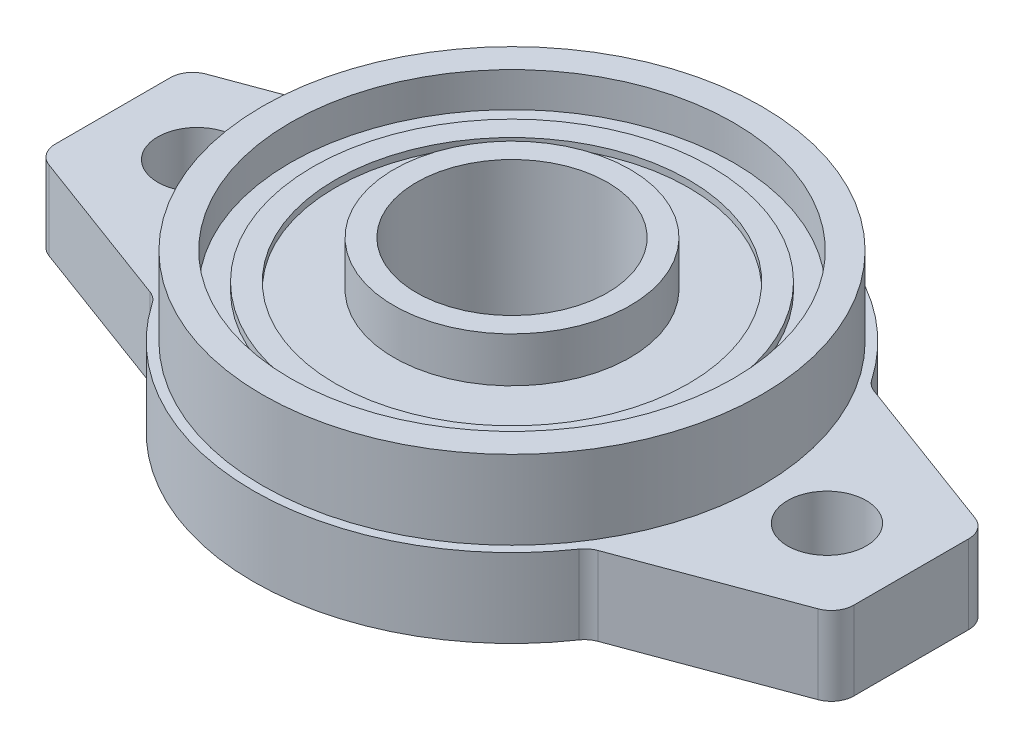
ISO-10303-21;
HEADER;
FILE_DESCRIPTION(('STEP AP214'),'2;1');
FILE_NAME('part.step','',(''),(''),'','','');
FILE_SCHEMA(('AUTOMOTIVE_DESIGN { 1 0 10303 214 1 1 1 1 }'));
ENDSEC;
DATA;
#1=APPLICATION_CONTEXT('core data for automotive mechanical design processes');
#2=APPLICATION_PROTOCOL_DEFINITION('international standard','automotive_design',2000,#1);
#3=PRODUCT_CONTEXT('',#1,'mechanical');
#4=PRODUCT('Part','Part','',(#3));
#5=PRODUCT_RELATED_PRODUCT_CATEGORY('part','',(#4));
#6=PRODUCT_DEFINITION_FORMATION('','',#4);
#7=PRODUCT_DEFINITION_CONTEXT('part definition',#1,'design');
#8=PRODUCT_DEFINITION('design','',#6,#7);
#9=PRODUCT_DEFINITION_SHAPE('','',#8);
#10=(LENGTH_UNIT() NAMED_UNIT(*) SI_UNIT(.MILLI.,.METRE.));
#11=(NAMED_UNIT(*) PLANE_ANGLE_UNIT() SI_UNIT($,.RADIAN.));
#12=(NAMED_UNIT(*) SI_UNIT($,.STERADIAN.) SOLID_ANGLE_UNIT());
#13=UNCERTAINTY_MEASURE_WITH_UNIT(LENGTH_MEASURE(1.E-05),#10,'distance_accuracy_value','');
#14=(GEOMETRIC_REPRESENTATION_CONTEXT(3) GLOBAL_UNCERTAINTY_ASSIGNED_CONTEXT((#13)) GLOBAL_UNIT_ASSIGNED_CONTEXT((#10,
#11,#12)) REPRESENTATION_CONTEXT('',''));
#15=CARTESIAN_POINT('',(0.,0.,0.));
#16=DIRECTION('',(0.,0.,1.));
#17=DIRECTION('',(1.,0.,0.));
#18=AXIS2_PLACEMENT_3D('',#15,#16,#17);
#19=CARTESIAN_POINT('',(-20.6101915487471,7.,-14.1499118132925));
#20=DIRECTION('',(0.,1.,0.));
#21=DIRECTION('',(0.,0.,1.));
#22=AXIS2_PLACEMENT_3D('',#19,#20,#21);
#23=PLANE('',#22);
#24=CARTESIAN_POINT('',(28.,7.,0.));
#25=DIRECTION('',(0.,1.,0.));
#26=DIRECTION('',(0.,0.,1.));
#27=AXIS2_PLACEMENT_3D('',#24,#25,#26);
#28=CIRCLE('',#27,3.5);
#29=CARTESIAN_POINT('',(28.,7.,3.5));
#30=VERTEX_POINT('',#29);
#31=EDGE_CURVE('E188',#30,#30,#28,.T.);
#32=ORIENTED_EDGE('',*,*,#31,.F.);
#33=EDGE_LOOP('',(#32));
#34=FACE_BOUND('',#33,.T.);
#35=CARTESIAN_POINT('',(-20.6101915487471,7.,-14.1499118132925));
#36=DIRECTION('',(0.,-1.,0.));
#37=DIRECTION('',(0.,0.,1.));
#38=AXIS2_PLACEMENT_3D('',#35,#36,#37);
#39=CIRCLE('',#38,2.);
#40=CARTESIAN_POINT('',(-18.9613762248473,7.,-13.0179188682291));
#41=VERTEX_POINT('',#40);
#42=CARTESIAN_POINT('',(-19.915308816529,7.,-12.2745083931012));
#43=VERTEX_POINT('',#42);
#44=EDGE_CURVE('E215',#41,#43,#39,.T.);
#45=ORIENTED_EDGE('',*,*,#44,.T.);
#46=DIRECTION('',(-0.93770171009564,0.,0.347441366109035));
#47=VECTOR('',#46,1.);
#48=CARTESIAN_POINT('',(-19.915308816529,7.,-12.2745083931012));
#49=LINE('',#48,#47);
#50=CARTESIAN_POINT('',(-34.1948827322181,7.,-6.98357779618894));
#51=VERTEX_POINT('',#50);
#52=EDGE_CURVE('E123',#43,#51,#49,.T.);
#53=ORIENTED_EDGE('',*,*,#52,.T.);
#54=CARTESIAN_POINT('',(-33.5,7.,-5.10817437599766));
#55=DIRECTION('',(0.,1.,0.));
#56=DIRECTION('',(0.,0.,1.));
#57=AXIS2_PLACEMENT_3D('',#54,#55,#56);
#58=CIRCLE('',#57,2.);
#59=CARTESIAN_POINT('',(-35.5,7.,-5.10817437599766));
#60=VERTEX_POINT('',#59);
#61=EDGE_CURVE('E254',#51,#60,#58,.T.);
#62=ORIENTED_EDGE('',*,*,#61,.T.);
#63=DIRECTION('',(0.,0.,1.));
#64=VECTOR('',#63,1.);
#65=CARTESIAN_POINT('',(-35.5,7.,-5.10817437599766));
#66=LINE('',#65,#64);
#67=CARTESIAN_POINT('',(-35.5,7.,5.10817437599766));
#68=VERTEX_POINT('',#67);
#69=EDGE_CURVE('E273',#60,#68,#66,.T.);
#70=ORIENTED_EDGE('',*,*,#69,.T.);
#71=CARTESIAN_POINT('',(-33.5,7.,5.10817437599766));
#72=DIRECTION('',(0.,1.,0.));
#73=DIRECTION('',(0.,0.,-1.));
#74=AXIS2_PLACEMENT_3D('',#71,#72,#73);
#75=CIRCLE('',#74,2.);
#76=CARTESIAN_POINT('',(-34.1948827322181,7.,6.98357779618894));
#77=VERTEX_POINT('',#76);
#78=EDGE_CURVE('E270',#68,#77,#75,.T.);
#79=ORIENTED_EDGE('',*,*,#78,.T.);
#80=DIRECTION('',(0.93770171009564,0.,0.347441366109035));
#81=VECTOR('',#80,1.);
#82=CARTESIAN_POINT('',(-34.1948827322181,7.,6.98357779618894));
#83=LINE('',#82,#81);
#84=CARTESIAN_POINT('',(-19.915308816529,7.,12.2745083931012));
#85=VERTEX_POINT('',#84);
#86=EDGE_CURVE('E272',#77,#85,#83,.T.);
#87=ORIENTED_EDGE('',*,*,#86,.T.);
#88=CARTESIAN_POINT('',(-20.6101915487471,7.,14.1499118132925));
#89=DIRECTION('',(0.,-1.,0.));
#90=DIRECTION('',(0.,0.,-1.));
#91=AXIS2_PLACEMENT_3D('',#88,#89,#90);
#92=CIRCLE('',#91,2.);
#93=CARTESIAN_POINT('',(-18.9613762248473,7.,13.0179188682291));
#94=VERTEX_POINT('',#93);
#95=EDGE_CURVE('E275',#85,#94,#92,.T.);
#96=ORIENTED_EDGE('',*,*,#95,.T.);
#97=CARTESIAN_POINT('',(0.,7.,0.));
#98=DIRECTION('',(0.,1.,0.));
#99=DIRECTION('',(0.,0.,1.));
#100=AXIS2_PLACEMENT_3D('',#97,#98,#99);
#101=CIRCLE('',#100,23.);
#102=CARTESIAN_POINT('',(18.9613762248473,7.,13.0179188682291));
#103=VERTEX_POINT('',#102);
#104=EDGE_CURVE('E281',#94,#103,#101,.T.);
#105=ORIENTED_EDGE('',*,*,#104,.T.);
#106=CARTESIAN_POINT('',(20.6101915487471,7.,14.1499118132925));
#107=DIRECTION('',(0.,-1.,0.));
#108=DIRECTION('',(0.,0.,1.));
#109=AXIS2_PLACEMENT_3D('',#106,#107,#108);
#110=CIRCLE('',#109,2.);
#111=CARTESIAN_POINT('',(19.915308816529,7.,12.2745083931012));
#112=VERTEX_POINT('',#111);
#113=EDGE_CURVE('E283',#103,#112,#110,.T.);
#114=ORIENTED_EDGE('',*,*,#113,.T.);
#115=DIRECTION('',(0.93770171009564,0.,-0.347441366109035));
#116=VECTOR('',#115,1.);
#117=CARTESIAN_POINT('',(34.1948827322181,7.,6.98357779618894));
#118=LINE('',#117,#116);
#119=CARTESIAN_POINT('',(34.1948827322181,7.,6.98357779618894));
#120=VERTEX_POINT('',#119);
#121=EDGE_CURVE('E285',#112,#120,#118,.T.);
#122=ORIENTED_EDGE('',*,*,#121,.T.);
#123=CARTESIAN_POINT('',(33.5,7.,5.10817437599766));
#124=DIRECTION('',(0.,1.,0.));
#125=DIRECTION('',(0.,0.,-1.));
#126=AXIS2_PLACEMENT_3D('',#123,#124,#125);
#127=CIRCLE('',#126,2.);
#128=CARTESIAN_POINT('',(35.5,7.,5.10817437599766));
#129=VERTEX_POINT('',#128);
#130=EDGE_CURVE('E287',#120,#129,#127,.T.);
#131=ORIENTED_EDGE('',*,*,#130,.T.);
#132=DIRECTION('',(0.,0.,-1.));
#133=VECTOR('',#132,1.);
#134=CARTESIAN_POINT('',(35.5,7.,-5.10817437599766));
#135=LINE('',#134,#133);
#136=CARTESIAN_POINT('',(35.5,7.,-5.10817437599766));
#137=VERTEX_POINT('',#136);
#138=EDGE_CURVE('E289',#129,#137,#135,.T.);
#139=ORIENTED_EDGE('',*,*,#138,.T.);
#140=CARTESIAN_POINT('',(33.5,7.,-5.10817437599766));
#141=DIRECTION('',(0.,1.,0.));
#142=DIRECTION('',(0.,0.,-1.));
#143=AXIS2_PLACEMENT_3D('',#140,#141,#142);
#144=CIRCLE('',#143,2.);
#145=CARTESIAN_POINT('',(34.1948827322181,7.,-6.98357779618894));
#146=VERTEX_POINT('',#145);
#147=EDGE_CURVE('E166',#137,#146,#144,.T.);
#148=ORIENTED_EDGE('',*,*,#147,.T.);
#149=DIRECTION('',(-0.93770171009564,0.,-0.347441366109035));
#150=VECTOR('',#149,1.);
#151=CARTESIAN_POINT('',(19.915308816529,7.,-12.2745083931012));
#152=LINE('',#151,#150);
#153=CARTESIAN_POINT('',(19.915308816529,7.,-12.2745083931012));
#154=VERTEX_POINT('',#153);
#155=EDGE_CURVE('E160',#146,#154,#152,.T.);
#156=ORIENTED_EDGE('',*,*,#155,.T.);
#157=CARTESIAN_POINT('',(20.6101915487471,7.,-14.1499118132925));
#158=DIRECTION('',(0.,-1.,0.));
#159=DIRECTION('',(0.,0.,-1.));
#160=AXIS2_PLACEMENT_3D('',#157,#158,#159);
#161=CIRCLE('',#160,2.);
#162=CARTESIAN_POINT('',(18.9613762248473,7.,-13.0179188682291));
#163=VERTEX_POINT('',#162);
#164=EDGE_CURVE('E164',#154,#163,#161,.T.);
#165=ORIENTED_EDGE('',*,*,#164,.T.);
#166=CARTESIAN_POINT('',(0.,7.,0.));
#167=DIRECTION('',(0.,1.,0.));
#168=DIRECTION('',(0.,0.,1.));
#169=AXIS2_PLACEMENT_3D('',#166,#167,#168);
#170=CIRCLE('',#169,23.);
#171=EDGE_CURVE('E56',#163,#41,#170,.T.);
#172=ORIENTED_EDGE('',*,*,#171,.T.);
#173=EDGE_LOOP('',(#45,#53,#62,#70,#79,#87,#96,#105,#114,#122,#131,#139,#148,#156,#165,#172));
#174=FACE_BOUND('',#173,.T.);
#175=CARTESIAN_POINT('',(-28.,7.,0.));
#176=DIRECTION('',(0.,1.,0.));
#177=DIRECTION('',(0.,0.,1.));
#178=AXIS2_PLACEMENT_3D('',#175,#176,#177);
#179=CIRCLE('',#178,3.5);
#180=CARTESIAN_POINT('',(-28.,7.,3.5));
#181=VERTEX_POINT('',#180);
#182=EDGE_CURVE('E412',#181,#181,#179,.T.);
#183=ORIENTED_EDGE('',*,*,#182,.F.);
#184=EDGE_LOOP('',(#183));
#185=FACE_BOUND('',#184,.T.);
#186=CARTESIAN_POINT('',(0.,7.,0.));
#187=DIRECTION('',(0.,-1.,0.));
#188=DIRECTION('',(0.,0.,-1.));
#189=AXIS2_PLACEMENT_3D('',#186,#187,#188);
#190=CIRCLE('',#189,22.2);
#191=CARTESIAN_POINT('',(0.,7.,-22.2));
#192=VERTEX_POINT('',#191);
#193=EDGE_CURVE('E375',#192,#192,#190,.T.);
#194=ORIENTED_EDGE('',*,*,#193,.T.);
#195=EDGE_LOOP('',(#194));
#196=FACE_BOUND('',#195,.T.);
#197=ADVANCED_FACE('F39',(#34,#174,#185,#196),#23,.T.);
#198=CARTESIAN_POINT('',(-20.6101915487471,0.,-14.1499118132925));
#199=DIRECTION('',(0.,1.,0.));
#200=DIRECTION('',(0.,0.,1.));
#201=AXIS2_PLACEMENT_3D('',#198,#199,#200);
#202=PLANE('',#201);
#203=CARTESIAN_POINT('',(-20.6101915487471,0.,-14.1499118132925));
#204=DIRECTION('',(0.,-1.,0.));
#205=DIRECTION('',(0.,0.,1.));
#206=AXIS2_PLACEMENT_3D('',#203,#204,#205);
#207=CIRCLE('',#206,2.);
#208=CARTESIAN_POINT('',(-18.9613762248473,0.,-13.0179188682291));
#209=VERTEX_POINT('',#208);
#210=CARTESIAN_POINT('',(-19.915308816529,0.,-12.2745083931012));
#211=VERTEX_POINT('',#210);
#212=EDGE_CURVE('E184',#209,#211,#207,.T.);
#213=ORIENTED_EDGE('',*,*,#212,.F.);
#214=CARTESIAN_POINT('',(0.,0.,0.));
#215=DIRECTION('',(0.,1.,0.));
#216=DIRECTION('',(0.,0.,1.));
#217=AXIS2_PLACEMENT_3D('',#214,#215,#216);
#218=CIRCLE('',#217,23.);
#219=CARTESIAN_POINT('',(18.9613762248473,0.,-13.0179188682291));
#220=VERTEX_POINT('',#219);
#221=EDGE_CURVE('E115',#220,#209,#218,.T.);
#222=ORIENTED_EDGE('',*,*,#221,.F.);
#223=CARTESIAN_POINT('',(20.6101915487471,0.,-14.1499118132925));
#224=DIRECTION('',(0.,-1.,0.));
#225=DIRECTION('',(0.,0.,-1.));
#226=AXIS2_PLACEMENT_3D('',#223,#224,#225);
#227=CIRCLE('',#226,2.);
#228=CARTESIAN_POINT('',(19.915308816529,0.,-12.2745083931012));
#229=VERTEX_POINT('',#228);
#230=EDGE_CURVE('E109',#229,#220,#227,.T.);
#231=ORIENTED_EDGE('',*,*,#230,.F.);
#232=DIRECTION('',(-0.93770171009564,0.,-0.347441366109035));
#233=VECTOR('',#232,1.);
#234=CARTESIAN_POINT('',(19.915308816529,0.,-12.2745083931012));
#235=LINE('',#234,#233);
#236=CARTESIAN_POINT('',(34.1948827322181,0.,-6.98357779618894));
#237=VERTEX_POINT('',#236);
#238=EDGE_CURVE('E174',#237,#229,#235,.T.);
#239=ORIENTED_EDGE('',*,*,#238,.F.);
#240=CARTESIAN_POINT('',(33.5,0.,-5.10817437599766));
#241=DIRECTION('',(0.,1.,0.));
#242=DIRECTION('',(0.,0.,-1.));
#243=AXIS2_PLACEMENT_3D('',#240,#241,#242);
#244=CIRCLE('',#243,2.);
#245=CARTESIAN_POINT('',(35.5,0.,-5.10817437599766));
#246=VERTEX_POINT('',#245);
#247=EDGE_CURVE('E210',#246,#237,#244,.T.);
#248=ORIENTED_EDGE('',*,*,#247,.F.);
#249=DIRECTION('',(0.,0.,-1.));
#250=VECTOR('',#249,1.);
#251=CARTESIAN_POINT('',(35.5,0.,-5.10817437599766));
#252=LINE('',#251,#250);
#253=CARTESIAN_POINT('',(35.5,0.,5.10817437599766));
#254=VERTEX_POINT('',#253);
#255=EDGE_CURVE('E208',#254,#246,#252,.T.);
#256=ORIENTED_EDGE('',*,*,#255,.F.);
#257=CARTESIAN_POINT('',(33.5,0.,5.10817437599766));
#258=DIRECTION('',(0.,1.,0.));
#259=DIRECTION('',(0.,0.,-1.));
#260=AXIS2_PLACEMENT_3D('',#257,#258,#259);
#261=CIRCLE('',#260,2.);
#262=CARTESIAN_POINT('',(34.1948827322181,0.,6.98357779618894));
#263=VERTEX_POINT('',#262);
#264=EDGE_CURVE('E206',#263,#254,#261,.T.);
#265=ORIENTED_EDGE('',*,*,#264,.F.);
#266=DIRECTION('',(0.93770171009564,0.,-0.347441366109035));
#267=VECTOR('',#266,1.);
#268=CARTESIAN_POINT('',(34.1948827322181,0.,6.98357779618894));
#269=LINE('',#268,#267);
#270=CARTESIAN_POINT('',(19.915308816529,0.,12.2745083931012));
#271=VERTEX_POINT('',#270);
#272=EDGE_CURVE('E204',#271,#263,#269,.T.);
#273=ORIENTED_EDGE('',*,*,#272,.F.);
#274=CARTESIAN_POINT('',(20.6101915487471,0.,14.1499118132925));
#275=DIRECTION('',(0.,-1.,0.));
#276=DIRECTION('',(0.,0.,1.));
#277=AXIS2_PLACEMENT_3D('',#274,#275,#276);
#278=CIRCLE('',#277,2.);
#279=CARTESIAN_POINT('',(18.9613762248473,0.,13.0179188682291));
#280=VERTEX_POINT('',#279);
#281=EDGE_CURVE('E202',#280,#271,#278,.T.);
#282=ORIENTED_EDGE('',*,*,#281,.F.);
#283=CARTESIAN_POINT('',(0.,0.,0.));
#284=DIRECTION('',(0.,1.,0.));
#285=DIRECTION('',(0.,0.,1.));
#286=AXIS2_PLACEMENT_3D('',#283,#284,#285);
#287=CIRCLE('',#286,23.);
#288=CARTESIAN_POINT('',(-18.9613762248473,0.,13.0179188682291));
#289=VERTEX_POINT('',#288);
#290=EDGE_CURVE('E200',#289,#280,#287,.T.);
#291=ORIENTED_EDGE('',*,*,#290,.F.);
#292=CARTESIAN_POINT('',(-20.6101915487471,0.,14.1499118132925));
#293=DIRECTION('',(0.,-1.,0.));
#294=DIRECTION('',(0.,0.,-1.));
#295=AXIS2_PLACEMENT_3D('',#292,#293,#294);
#296=CIRCLE('',#295,2.);
#297=CARTESIAN_POINT('',(-19.915308816529,0.,12.2745083931012));
#298=VERTEX_POINT('',#297);
#299=EDGE_CURVE('E198',#298,#289,#296,.T.);
#300=ORIENTED_EDGE('',*,*,#299,.F.);
#301=DIRECTION('',(0.93770171009564,0.,0.347441366109035));
#302=VECTOR('',#301,1.);
#303=CARTESIAN_POINT('',(-34.1948827322181,0.,6.98357779618894));
#304=LINE('',#303,#302);
#305=CARTESIAN_POINT('',(-34.1948827322181,0.,6.98357779618894));
#306=VERTEX_POINT('',#305);
#307=EDGE_CURVE('E196',#306,#298,#304,.T.);
#308=ORIENTED_EDGE('',*,*,#307,.F.);
#309=CARTESIAN_POINT('',(-33.5,0.,5.10817437599766));
#310=DIRECTION('',(0.,1.,0.));
#311=DIRECTION('',(0.,0.,-1.));
#312=AXIS2_PLACEMENT_3D('',#309,#310,#311);
#313=CIRCLE('',#312,2.);
#314=CARTESIAN_POINT('',(-35.5,0.,5.10817437599766));
#315=VERTEX_POINT('',#314);
#316=EDGE_CURVE('E194',#315,#306,#313,.T.);
#317=ORIENTED_EDGE('',*,*,#316,.F.);
#318=DIRECTION('',(0.,0.,1.));
#319=VECTOR('',#318,1.);
#320=CARTESIAN_POINT('',(-35.5,0.,-5.10817437599766));
#321=LINE('',#320,#319);
#322=CARTESIAN_POINT('',(-35.5,0.,-5.10817437599766));
#323=VERTEX_POINT('',#322);
#324=EDGE_CURVE('E192',#323,#315,#321,.T.);
#325=ORIENTED_EDGE('',*,*,#324,.F.);
#326=CARTESIAN_POINT('',(-33.5,0.,-5.10817437599766));
#327=DIRECTION('',(0.,1.,0.));
#328=DIRECTION('',(0.,0.,1.));
#329=AXIS2_PLACEMENT_3D('',#326,#327,#328);
#330=CIRCLE('',#329,2.);
#331=CARTESIAN_POINT('',(-34.1948827322181,0.,-6.98357779618894));
#332=VERTEX_POINT('',#331);
#333=EDGE_CURVE('E190',#332,#323,#330,.T.);
#334=ORIENTED_EDGE('',*,*,#333,.F.);
#335=DIRECTION('',(-0.93770171009564,0.,0.347441366109035));
#336=VECTOR('',#335,1.);
#337=CARTESIAN_POINT('',(-19.915308816529,0.,-12.2745083931012));
#338=LINE('',#337,#336);
#339=EDGE_CURVE('E187',#211,#332,#338,.T.);
#340=ORIENTED_EDGE('',*,*,#339,.F.);
#341=EDGE_LOOP('',(#213,#222,#231,#239,#248,#256,#265,#273,#282,#291,#300,#308,#317,#325,#334,#340));
#342=FACE_BOUND('',#341,.T.);
#343=CARTESIAN_POINT('',(28.,0.,0.));
#344=DIRECTION('',(0.,1.,0.));
#345=DIRECTION('',(0.,0.,1.));
#346=AXIS2_PLACEMENT_3D('',#343,#344,#345);
#347=CIRCLE('',#346,3.5);
#348=CARTESIAN_POINT('',(28.,0.,3.5));
#349=VERTEX_POINT('',#348);
#350=EDGE_CURVE('E415',#349,#349,#347,.T.);
#351=ORIENTED_EDGE('',*,*,#350,.T.);
#352=EDGE_LOOP('',(#351));
#353=FACE_BOUND('',#352,.T.);
#354=CARTESIAN_POINT('',(-28.,0.,0.));
#355=DIRECTION('',(0.,1.,0.));
#356=DIRECTION('',(0.,0.,1.));
#357=AXIS2_PLACEMENT_3D('',#354,#355,#356);
#358=CIRCLE('',#357,3.5);
#359=CARTESIAN_POINT('',(-28.,0.,3.5));
#360=VERTEX_POINT('',#359);
#361=EDGE_CURVE('E411',#360,#360,#358,.T.);
#362=ORIENTED_EDGE('',*,*,#361,.T.);
#363=EDGE_LOOP('',(#362));
#364=FACE_BOUND('',#363,.T.);
#365=CARTESIAN_POINT('',(0.,0.,0.));
#366=DIRECTION('',(0.,1.,0.));
#367=DIRECTION('',(0.,0.,1.));
#368=AXIS2_PLACEMENT_3D('',#365,#366,#367);
#369=CIRCLE('',#368,8.5);
#370=CARTESIAN_POINT('',(0.,0.,8.5));
#371=VERTEX_POINT('',#370);
#372=EDGE_CURVE('E408',#371,#371,#369,.T.);
#373=ORIENTED_EDGE('',*,*,#372,.T.);
#374=EDGE_LOOP('',(#373));
#375=FACE_BOUND('',#374,.T.);
#376=ADVANCED_FACE('F258',(#342,#353,#364,#375),#202,.F.);
#377=CARTESIAN_POINT('',(-20.6101915487471,7.,-14.1499118132925));
#378=DIRECTION('',(0.,-1.,0.));
#379=DIRECTION('',(0.,0.,-1.));
#380=AXIS2_PLACEMENT_3D('',#377,#378,#379);
#381=CYLINDRICAL_SURFACE('',#380,2.);
#382=ORIENTED_EDGE('',*,*,#212,.T.);
#383=DIRECTION('',(0.,-1.,0.));
#384=VECTOR('',#383,1.);
#385=CARTESIAN_POINT('',(-19.915308816529,7.,-12.2745083931012));
#386=LINE('',#385,#384);
#387=EDGE_CURVE('E11',#43,#211,#386,.T.);
#388=ORIENTED_EDGE('',*,*,#387,.F.);
#389=ORIENTED_EDGE('',*,*,#44,.F.);
#390=DIRECTION('',(0.,-1.,0.));
#391=VECTOR('',#390,1.);
#392=CARTESIAN_POINT('',(-18.9613762248473,7.,-13.0179188682291));
#393=LINE('',#392,#391);
#394=EDGE_CURVE('E180',#41,#209,#393,.T.);
#395=ORIENTED_EDGE('',*,*,#394,.T.);
#396=EDGE_LOOP('',(#382,#388,#389,#395));
#397=FACE_BOUND('',#396,.T.);
#398=ADVANCED_FACE('F41',(#397),#381,.F.);
#399=CARTESIAN_POINT('',(-19.915308816529,7.,-12.2745083931012));
#400=DIRECTION('',(0.347441366109035,0.,0.93770171009564));
#401=DIRECTION('',(0.93770171009564,0.,-0.347441366109035));
#402=AXIS2_PLACEMENT_3D('',#399,#400,#401);
#403=PLANE('',#402);
#404=ORIENTED_EDGE('',*,*,#339,.T.);
#405=DIRECTION('',(0.,-1.,0.));
#406=VECTOR('',#405,1.);
#407=CARTESIAN_POINT('',(-34.1948827322181,7.,-6.98357779618894));
#408=LINE('',#407,#406);
#409=EDGE_CURVE('E48',#51,#332,#408,.T.);
#410=ORIENTED_EDGE('',*,*,#409,.F.);
#411=ORIENTED_EDGE('',*,*,#52,.F.);
#412=ORIENTED_EDGE('',*,*,#387,.T.);
#413=EDGE_LOOP('',(#404,#410,#411,#412));
#414=FACE_BOUND('',#413,.T.);
#415=ADVANCED_FACE('F619',(#414),#403,.F.);
#416=CARTESIAN_POINT('',(-33.5,7.,-5.10817437599766));
#417=DIRECTION('',(0.,-1.,0.));
#418=DIRECTION('',(0.,0.,-1.));
#419=AXIS2_PLACEMENT_3D('',#416,#417,#418);
#420=CYLINDRICAL_SURFACE('',#419,2.);
#421=ORIENTED_EDGE('',*,*,#333,.T.);
#422=DIRECTION('',(0.,-1.,0.));
#423=VECTOR('',#422,1.);
#424=CARTESIAN_POINT('',(-35.5,7.,-5.10817437599766));
#425=LINE('',#424,#423);
#426=EDGE_CURVE('E246',#60,#323,#425,.T.);
#427=ORIENTED_EDGE('',*,*,#426,.F.);
#428=ORIENTED_EDGE('',*,*,#61,.F.);
#429=ORIENTED_EDGE('',*,*,#409,.T.);
#430=EDGE_LOOP('',(#421,#427,#428,#429));
#431=FACE_BOUND('',#430,.T.);
#432=ADVANCED_FACE('F252',(#431),#420,.T.);
#433=CARTESIAN_POINT('',(-35.5,7.,-5.10817437599766));
#434=DIRECTION('',(1.,0.,0.));
#435=DIRECTION('',(0.,0.,-1.));
#436=AXIS2_PLACEMENT_3D('',#433,#434,#435);
#437=PLANE('',#436);
#438=ORIENTED_EDGE('',*,*,#324,.T.);
#439=DIRECTION('',(0.,-1.,0.));
#440=VECTOR('',#439,1.);
#441=CARTESIAN_POINT('',(-35.5,7.,5.10817437599766));
#442=LINE('',#441,#440);
#443=EDGE_CURVE('E243',#68,#315,#442,.T.);
#444=ORIENTED_EDGE('',*,*,#443,.F.);
#445=ORIENTED_EDGE('',*,*,#69,.F.);
#446=ORIENTED_EDGE('',*,*,#426,.T.);
#447=EDGE_LOOP('',(#438,#444,#445,#446));
#448=FACE_BOUND('',#447,.T.);
#449=ADVANCED_FACE('F264',(#448),#437,.F.);
#450=CARTESIAN_POINT('',(-33.5,7.,5.10817437599766));
#451=DIRECTION('',(0.,-1.,0.));
#452=DIRECTION('',(0.,0.,-1.));
#453=AXIS2_PLACEMENT_3D('',#450,#451,#452);
#454=CYLINDRICAL_SURFACE('',#453,2.);
#455=ORIENTED_EDGE('',*,*,#316,.T.);
#456=DIRECTION('',(0.,-1.,0.));
#457=VECTOR('',#456,1.);
#458=CARTESIAN_POINT('',(-34.1948827322181,7.,6.98357779618894));
#459=LINE('',#458,#457);
#460=EDGE_CURVE('E240',#77,#306,#459,.T.);
#461=ORIENTED_EDGE('',*,*,#460,.F.);
#462=ORIENTED_EDGE('',*,*,#78,.F.);
#463=ORIENTED_EDGE('',*,*,#443,.T.);
#464=EDGE_LOOP('',(#455,#461,#462,#463));
#465=FACE_BOUND('',#464,.T.);
#466=ADVANCED_FACE('F268',(#465),#454,.T.);
#467=CARTESIAN_POINT('',(-34.1948827322181,7.,6.98357779618894));
#468=DIRECTION('',(0.347441366109035,0.,-0.93770171009564));
#469=DIRECTION('',(-0.93770171009564,0.,-0.347441366109035));
#470=AXIS2_PLACEMENT_3D('',#467,#468,#469);
#471=PLANE('',#470);
#472=ORIENTED_EDGE('',*,*,#307,.T.);
#473=DIRECTION('',(0.,-1.,0.));
#474=VECTOR('',#473,1.);
#475=CARTESIAN_POINT('',(-19.915308816529,7.,12.2745083931012));
#476=LINE('',#475,#474);
#477=EDGE_CURVE('E237',#85,#298,#476,.T.);
#478=ORIENTED_EDGE('',*,*,#477,.F.);
#479=ORIENTED_EDGE('',*,*,#86,.F.);
#480=ORIENTED_EDGE('',*,*,#460,.T.);
#481=EDGE_LOOP('',(#472,#478,#479,#480));
#482=FACE_BOUND('',#481,.T.);
#483=ADVANCED_FACE('F584',(#482),#471,.F.);
#484=CARTESIAN_POINT('',(-20.6101915487471,7.,14.1499118132925));
#485=DIRECTION('',(0.,-1.,0.));
#486=DIRECTION('',(0.,0.,-1.));
#487=AXIS2_PLACEMENT_3D('',#484,#485,#486);
#488=CYLINDRICAL_SURFACE('',#487,2.);
#489=ORIENTED_EDGE('',*,*,#299,.T.);
#490=DIRECTION('',(0.,-1.,0.));
#491=VECTOR('',#490,1.);
#492=CARTESIAN_POINT('',(-18.9613762248473,7.,13.0179188682291));
#493=LINE('',#492,#491);
#494=EDGE_CURVE('E234',#94,#289,#493,.T.);
#495=ORIENTED_EDGE('',*,*,#494,.F.);
#496=ORIENTED_EDGE('',*,*,#95,.F.);
#497=ORIENTED_EDGE('',*,*,#477,.T.);
#498=EDGE_LOOP('',(#489,#495,#496,#497));
#499=FACE_BOUND('',#498,.T.);
#500=ADVANCED_FACE('F574',(#499),#488,.F.);
#501=CARTESIAN_POINT('',(0.,7.,0.));
#502=DIRECTION('',(0.,-1.,0.));
#503=DIRECTION('',(0.,0.,-1.));
#504=AXIS2_PLACEMENT_3D('',#501,#502,#503);
#505=CYLINDRICAL_SURFACE('',#504,23.);
#506=ORIENTED_EDGE('',*,*,#290,.T.);
#507=DIRECTION('',(0.,-1.,0.));
#508=VECTOR('',#507,1.);
#509=CARTESIAN_POINT('',(18.9613762248473,7.,13.0179188682291));
#510=LINE('',#509,#508);
#511=EDGE_CURVE('E231',#103,#280,#510,.T.);
#512=ORIENTED_EDGE('',*,*,#511,.F.);
#513=ORIENTED_EDGE('',*,*,#104,.F.);
#514=ORIENTED_EDGE('',*,*,#494,.T.);
#515=EDGE_LOOP('',(#506,#512,#513,#514));
#516=FACE_BOUND('',#515,.T.);
#517=ADVANCED_FACE('F564',(#516),#505,.T.);
#518=CARTESIAN_POINT('',(20.6101915487471,7.,14.1499118132925));
#519=DIRECTION('',(0.,-1.,0.));
#520=DIRECTION('',(0.,0.,-1.));
#521=AXIS2_PLACEMENT_3D('',#518,#519,#520);
#522=CYLINDRICAL_SURFACE('',#521,2.);
#523=ORIENTED_EDGE('',*,*,#281,.T.);
#524=DIRECTION('',(0.,-1.,0.));
#525=VECTOR('',#524,1.);
#526=CARTESIAN_POINT('',(19.915308816529,7.,12.2745083931012));
#527=LINE('',#526,#525);
#528=EDGE_CURVE('E228',#112,#271,#527,.T.);
#529=ORIENTED_EDGE('',*,*,#528,.F.);
#530=ORIENTED_EDGE('',*,*,#113,.F.);
#531=ORIENTED_EDGE('',*,*,#511,.T.);
#532=EDGE_LOOP('',(#523,#529,#530,#531));
#533=FACE_BOUND('',#532,.T.);
#534=ADVANCED_FACE('F554',(#533),#522,.F.);
#535=CARTESIAN_POINT('',(34.1948827322181,7.,6.98357779618894));
#536=DIRECTION('',(-0.347441366109035,0.,-0.93770171009564));
#537=DIRECTION('',(-0.93770171009564,0.,0.347441366109035));
#538=AXIS2_PLACEMENT_3D('',#535,#536,#537);
#539=PLANE('',#538);
#540=ORIENTED_EDGE('',*,*,#272,.T.);
#541=DIRECTION('',(0.,-1.,0.));
#542=VECTOR('',#541,1.);
#543=CARTESIAN_POINT('',(34.1948827322181,7.,6.98357779618894));
#544=LINE('',#543,#542);
#545=EDGE_CURVE('E225',#120,#263,#544,.T.);
#546=ORIENTED_EDGE('',*,*,#545,.F.);
#547=ORIENTED_EDGE('',*,*,#121,.F.);
#548=ORIENTED_EDGE('',*,*,#528,.T.);
#549=EDGE_LOOP('',(#540,#546,#547,#548));
#550=FACE_BOUND('',#549,.T.);
#551=ADVANCED_FACE('F544',(#550),#539,.F.);
#552=CARTESIAN_POINT('',(33.5,7.,5.10817437599766));
#553=DIRECTION('',(0.,-1.,0.));
#554=DIRECTION('',(0.,0.,-1.));
#555=AXIS2_PLACEMENT_3D('',#552,#553,#554);
#556=CYLINDRICAL_SURFACE('',#555,2.);
#557=ORIENTED_EDGE('',*,*,#264,.T.);
#558=DIRECTION('',(0.,-1.,0.));
#559=VECTOR('',#558,1.);
#560=CARTESIAN_POINT('',(35.5,7.,5.10817437599766));
#561=LINE('',#560,#559);
#562=EDGE_CURVE('E222',#129,#254,#561,.T.);
#563=ORIENTED_EDGE('',*,*,#562,.F.);
#564=ORIENTED_EDGE('',*,*,#130,.F.);
#565=ORIENTED_EDGE('',*,*,#545,.T.);
#566=EDGE_LOOP('',(#557,#563,#564,#565));
#567=FACE_BOUND('',#566,.T.);
#568=ADVANCED_FACE('F535',(#567),#556,.T.);
#569=CARTESIAN_POINT('',(35.5,7.,-5.10817437599766));
#570=DIRECTION('',(-1.,0.,0.));
#571=DIRECTION('',(0.,0.,1.));
#572=AXIS2_PLACEMENT_3D('',#569,#570,#571);
#573=PLANE('',#572);
#574=ORIENTED_EDGE('',*,*,#255,.T.);
#575=DIRECTION('',(0.,-1.,0.));
#576=VECTOR('',#575,1.);
#577=CARTESIAN_POINT('',(35.5,7.,-5.10817437599766));
#578=LINE('',#577,#576);
#579=EDGE_CURVE('E219',#137,#246,#578,.T.);
#580=ORIENTED_EDGE('',*,*,#579,.F.);
#581=ORIENTED_EDGE('',*,*,#138,.F.);
#582=ORIENTED_EDGE('',*,*,#562,.T.);
#583=EDGE_LOOP('',(#574,#580,#581,#582));
#584=FACE_BOUND('',#583,.T.);
#585=ADVANCED_FACE('F295',(#584),#573,.F.);
#586=CARTESIAN_POINT('',(33.5,7.,-5.10817437599766));
#587=DIRECTION('',(0.,-1.,0.));
#588=DIRECTION('',(0.,0.,-1.));
#589=AXIS2_PLACEMENT_3D('',#586,#587,#588);
#590=CYLINDRICAL_SURFACE('',#589,2.);
#591=ORIENTED_EDGE('',*,*,#247,.T.);
#592=DIRECTION('',(0.,-1.,0.));
#593=VECTOR('',#592,1.);
#594=CARTESIAN_POINT('',(34.1948827322181,7.,-6.98357779618894));
#595=LINE('',#594,#593);
#596=EDGE_CURVE('E175',#146,#237,#595,.T.);
#597=ORIENTED_EDGE('',*,*,#596,.F.);
#598=ORIENTED_EDGE('',*,*,#147,.F.);
#599=ORIENTED_EDGE('',*,*,#579,.T.);
#600=EDGE_LOOP('',(#591,#597,#598,#599));
#601=FACE_BOUND('',#600,.T.);
#602=ADVANCED_FACE('F299',(#601),#590,.T.);
#603=CARTESIAN_POINT('',(19.915308816529,7.,-12.2745083931012));
#604=DIRECTION('',(-0.347441366109035,0.,0.93770171009564));
#605=DIRECTION('',(0.93770171009564,0.,0.347441366109035));
#606=AXIS2_PLACEMENT_3D('',#603,#604,#605);
#607=PLANE('',#606);
#608=ORIENTED_EDGE('',*,*,#238,.T.);
#609=DIRECTION('',(0.,-1.,0.));
#610=VECTOR('',#609,1.);
#611=CARTESIAN_POINT('',(19.915308816529,7.,-12.2745083931012));
#612=LINE('',#611,#610);
#613=EDGE_CURVE('E171',#154,#229,#612,.T.);
#614=ORIENTED_EDGE('',*,*,#613,.F.);
#615=ORIENTED_EDGE('',*,*,#155,.F.);
#616=ORIENTED_EDGE('',*,*,#596,.T.);
#617=EDGE_LOOP('',(#608,#614,#615,#616));
#618=FACE_BOUND('',#617,.T.);
#619=ADVANCED_FACE('F172',(#618),#607,.F.);
#620=CARTESIAN_POINT('',(20.6101915487471,7.,-14.1499118132925));
#621=DIRECTION('',(0.,-1.,0.));
#622=DIRECTION('',(0.,0.,-1.));
#623=AXIS2_PLACEMENT_3D('',#620,#621,#622);
#624=CYLINDRICAL_SURFACE('',#623,2.);
#625=ORIENTED_EDGE('',*,*,#230,.T.);
#626=DIRECTION('',(0.,-1.,0.));
#627=VECTOR('',#626,1.);
#628=CARTESIAN_POINT('',(18.9613762248473,7.,-13.0179188682291));
#629=LINE('',#628,#627);
#630=EDGE_CURVE('E176',#163,#220,#629,.T.);
#631=ORIENTED_EDGE('',*,*,#630,.F.);
#632=ORIENTED_EDGE('',*,*,#164,.F.);
#633=ORIENTED_EDGE('',*,*,#613,.T.);
#634=EDGE_LOOP('',(#625,#631,#632,#633));
#635=FACE_BOUND('',#634,.T.);
#636=ADVANCED_FACE('F178',(#635),#624,.F.);
#637=CARTESIAN_POINT('',(0.,7.,0.));
#638=DIRECTION('',(0.,-1.,0.));
#639=DIRECTION('',(0.,0.,-1.));
#640=AXIS2_PLACEMENT_3D('',#637,#638,#639);
#641=CYLINDRICAL_SURFACE('',#640,23.);
#642=ORIENTED_EDGE('',*,*,#221,.T.);
#643=ORIENTED_EDGE('',*,*,#394,.F.);
#644=ORIENTED_EDGE('',*,*,#171,.F.);
#645=ORIENTED_EDGE('',*,*,#630,.T.);
#646=EDGE_LOOP('',(#642,#643,#644,#645));
#647=FACE_BOUND('',#646,.T.);
#648=ADVANCED_FACE('F303',(#647),#641,.T.);
#649=CARTESIAN_POINT('',(28.,7.,0.));
#650=DIRECTION('',(0.,-1.,0.));
#651=DIRECTION('',(0.,0.,-1.));
#652=AXIS2_PLACEMENT_3D('',#649,#650,#651);
#653=CYLINDRICAL_SURFACE('',#652,3.5);
#654=ORIENTED_EDGE('',*,*,#31,.T.);
#655=EDGE_LOOP('',(#654));
#656=FACE_BOUND('',#655,.T.);
#657=ORIENTED_EDGE('',*,*,#350,.F.);
#658=EDGE_LOOP('',(#657));
#659=FACE_BOUND('',#658,.T.);
#660=ADVANCED_FACE('F305',(#656,#659),#653,.F.);
#661=CARTESIAN_POINT('',(-28.,7.,0.));
#662=DIRECTION('',(0.,-1.,0.));
#663=DIRECTION('',(0.,0.,-1.));
#664=AXIS2_PLACEMENT_3D('',#661,#662,#663);
#665=CYLINDRICAL_SURFACE('',#664,3.5);
#666=ORIENTED_EDGE('',*,*,#182,.T.);
#667=EDGE_LOOP('',(#666));
#668=FACE_BOUND('',#667,.T.);
#669=ORIENTED_EDGE('',*,*,#361,.F.);
#670=EDGE_LOOP('',(#669));
#671=FACE_BOUND('',#670,.T.);
#672=ADVANCED_FACE('F311',(#668,#671),#665,.F.);
#673=CARTESIAN_POINT('',(0.,7.,0.));
#674=DIRECTION('',(0.,-1.,0.));
#675=DIRECTION('',(0.,0.,-1.));
#676=AXIS2_PLACEMENT_3D('',#673,#674,#675);
#677=CYLINDRICAL_SURFACE('',#676,8.5);
#678=ORIENTED_EDGE('',*,*,#372,.F.);
#679=EDGE_LOOP('',(#678));
#680=FACE_BOUND('',#679,.T.);
#681=CARTESIAN_POINT('',(0.,15.,0.));
#682=DIRECTION('',(0.,-1.,0.));
#683=DIRECTION('',(0.,0.,-1.));
#684=AXIS2_PLACEMENT_3D('',#681,#682,#683);
#685=CIRCLE('',#684,8.5);
#686=CARTESIAN_POINT('',(0.,15.,-8.5));
#687=VERTEX_POINT('',#686);
#688=EDGE_CURVE('E384',#687,#687,#685,.T.);
#689=ORIENTED_EDGE('',*,*,#688,.F.);
#690=EDGE_LOOP('',(#689));
#691=FACE_BOUND('',#690,.T.);
#692=ADVANCED_FACE('F326',(#680,#691),#677,.F.);
#693=CARTESIAN_POINT('',(-8.5,15.,0.));
#694=DIRECTION('',(0.,-1.,0.));
#695=DIRECTION('',(0.,0.,-1.));
#696=AXIS2_PLACEMENT_3D('',#693,#694,#695);
#697=PLANE('',#696);
#698=CARTESIAN_POINT('',(0.,15.,0.));
#699=DIRECTION('',(0.,-1.,0.));
#700=DIRECTION('',(0.,0.,-1.));
#701=AXIS2_PLACEMENT_3D('',#698,#699,#700);
#702=CIRCLE('',#701,10.5);
#703=CARTESIAN_POINT('',(0.,15.,-10.5));
#704=VERTEX_POINT('',#703);
#705=EDGE_CURVE('E405',#704,#704,#702,.T.);
#706=ORIENTED_EDGE('',*,*,#705,.F.);
#707=EDGE_LOOP('',(#706));
#708=FACE_BOUND('',#707,.T.);
#709=ORIENTED_EDGE('',*,*,#688,.T.);
#710=EDGE_LOOP('',(#709));
#711=FACE_BOUND('',#710,.T.);
#712=ADVANCED_FACE('F330',(#708,#711),#697,.F.);
#713=CARTESIAN_POINT('',(0.,0.,0.));
#714=DIRECTION('',(0.,-1.,0.));
#715=DIRECTION('',(0.,0.,-1.));
#716=AXIS2_PLACEMENT_3D('',#713,#714,#715);
#717=CYLINDRICAL_SURFACE('',#716,10.5);
#718=CARTESIAN_POINT('',(0.,11.,0.));
#719=DIRECTION('',(0.,-1.,0.));
#720=DIRECTION('',(0.,0.,-1.));
#721=AXIS2_PLACEMENT_3D('',#718,#719,#720);
#722=CIRCLE('',#721,10.5);
#723=CARTESIAN_POINT('',(0.,11.,-10.5));
#724=VERTEX_POINT('',#723);
#725=EDGE_CURVE('E402',#724,#724,#722,.T.);
#726=ORIENTED_EDGE('',*,*,#725,.F.);
#727=EDGE_LOOP('',(#726));
#728=FACE_BOUND('',#727,.T.);
#729=ORIENTED_EDGE('',*,*,#705,.T.);
#730=EDGE_LOOP('',(#729));
#731=FACE_BOUND('',#730,.T.);
#732=ADVANCED_FACE('F334',(#728,#731),#717,.T.);
#733=CARTESIAN_POINT('',(-10.5,11.,0.));
#734=DIRECTION('',(0.,-1.,0.));
#735=DIRECTION('',(0.,0.,-1.));
#736=AXIS2_PLACEMENT_3D('',#733,#734,#735);
#737=PLANE('',#736);
#738=CARTESIAN_POINT('',(0.,11.,0.));
#739=DIRECTION('',(0.,-1.,0.));
#740=DIRECTION('',(0.,0.,-1.));
#741=AXIS2_PLACEMENT_3D('',#738,#739,#740);
#742=CIRCLE('',#741,15.7);
#743=CARTESIAN_POINT('',(0.,11.,-15.7));
#744=VERTEX_POINT('',#743);
#745=EDGE_CURVE('E399',#744,#744,#742,.T.);
#746=ORIENTED_EDGE('',*,*,#745,.F.);
#747=EDGE_LOOP('',(#746));
#748=FACE_BOUND('',#747,.T.);
#749=ORIENTED_EDGE('',*,*,#725,.T.);
#750=EDGE_LOOP('',(#749));
#751=FACE_BOUND('',#750,.T.);
#752=ADVANCED_FACE('F338',(#748,#751),#737,.F.);
#753=CARTESIAN_POINT('',(0.,0.,0.));
#754=DIRECTION('',(0.,-1.,0.));
#755=DIRECTION('',(0.,0.,-1.));
#756=AXIS2_PLACEMENT_3D('',#753,#754,#755);
#757=CYLINDRICAL_SURFACE('',#756,15.7);
#758=CARTESIAN_POINT('',(0.,11.6,0.));
#759=DIRECTION('',(0.,-1.,0.));
#760=DIRECTION('',(0.,0.,-1.));
#761=AXIS2_PLACEMENT_3D('',#758,#759,#760);
#762=CIRCLE('',#761,15.7);
#763=CARTESIAN_POINT('',(0.,11.6,-15.7));
#764=VERTEX_POINT('',#763);
#765=EDGE_CURVE('E396',#764,#764,#762,.T.);
#766=ORIENTED_EDGE('',*,*,#765,.F.);
#767=EDGE_LOOP('',(#766));
#768=FACE_BOUND('',#767,.T.);
#769=ORIENTED_EDGE('',*,*,#745,.T.);
#770=EDGE_LOOP('',(#769));
#771=FACE_BOUND('',#770,.T.);
#772=ADVANCED_FACE('F342',(#768,#771),#757,.F.);
#773=CARTESIAN_POINT('',(-15.7,11.6,0.));
#774=DIRECTION('',(0.,-1.,0.));
#775=DIRECTION('',(0.,0.,-1.));
#776=AXIS2_PLACEMENT_3D('',#773,#774,#775);
#777=PLANE('',#776);
#778=CARTESIAN_POINT('',(0.,11.6,0.));
#779=DIRECTION('',(0.,-1.,0.));
#780=DIRECTION('',(0.,0.,-1.));
#781=AXIS2_PLACEMENT_3D('',#778,#779,#780);
#782=CIRCLE('',#781,17.7);
#783=CARTESIAN_POINT('',(0.,11.6,-17.7));
#784=VERTEX_POINT('',#783);
#785=EDGE_CURVE('E393',#784,#784,#782,.T.);
#786=ORIENTED_EDGE('',*,*,#785,.F.);
#787=EDGE_LOOP('',(#786));
#788=FACE_BOUND('',#787,.T.);
#789=ORIENTED_EDGE('',*,*,#765,.T.);
#790=EDGE_LOOP('',(#789));
#791=FACE_BOUND('',#790,.T.);
#792=ADVANCED_FACE('F346',(#788,#791),#777,.F.);
#793=CARTESIAN_POINT('',(0.,0.,0.));
#794=DIRECTION('',(0.,-1.,0.));
#795=DIRECTION('',(0.,0.,-1.));
#796=AXIS2_PLACEMENT_3D('',#793,#794,#795);
#797=CYLINDRICAL_SURFACE('',#796,17.7);
#798=CARTESIAN_POINT('',(0.,10.9182860818732,0.));
#799=DIRECTION('',(0.,-1.,0.));
#800=DIRECTION('',(0.,0.,-1.));
#801=AXIS2_PLACEMENT_3D('',#798,#799,#800);
#802=CIRCLE('',#801,17.7);
#803=CARTESIAN_POINT('',(0.,10.9182860818732,-17.7));
#804=VERTEX_POINT('',#803);
#805=EDGE_CURVE('E390',#804,#804,#802,.T.);
#806=ORIENTED_EDGE('',*,*,#805,.F.);
#807=EDGE_LOOP('',(#806));
#808=FACE_BOUND('',#807,.T.);
#809=ORIENTED_EDGE('',*,*,#785,.T.);
#810=EDGE_LOOP('',(#809));
#811=FACE_BOUND('',#810,.T.);
#812=ADVANCED_FACE('F350',(#808,#811),#797,.T.);
#813=CARTESIAN_POINT('',(-17.7,10.9182860818732,0.));
#814=DIRECTION('',(0.,-1.,0.));
#815=DIRECTION('',(0.,0.,-1.));
#816=AXIS2_PLACEMENT_3D('',#813,#814,#815);
#817=PLANE('',#816);
#818=CARTESIAN_POINT('',(0.,10.9182860818732,0.));
#819=DIRECTION('',(0.,-1.,0.));
#820=DIRECTION('',(0.,0.,-1.));
#821=AXIS2_PLACEMENT_3D('',#818,#819,#820);
#822=CIRCLE('',#821,19.7);
#823=CARTESIAN_POINT('',(0.,10.9182860818732,-19.7));
#824=VERTEX_POINT('',#823);
#825=EDGE_CURVE('E382',#824,#824,#822,.T.);
#826=ORIENTED_EDGE('',*,*,#825,.F.);
#827=EDGE_LOOP('',(#826));
#828=FACE_BOUND('',#827,.T.);
#829=ORIENTED_EDGE('',*,*,#805,.T.);
#830=EDGE_LOOP('',(#829));
#831=FACE_BOUND('',#830,.T.);
#832=ADVANCED_FACE('F354',(#828,#831),#817,.F.);
#833=CARTESIAN_POINT('',(0.,0.,0.));
#834=DIRECTION('',(0.,-1.,0.));
#835=DIRECTION('',(0.,0.,-1.));
#836=AXIS2_PLACEMENT_3D('',#833,#834,#835);
#837=CYLINDRICAL_SURFACE('',#836,19.7);
#838=CARTESIAN_POINT('',(0.,14.,0.));
#839=DIRECTION('',(0.,-1.,0.));
#840=DIRECTION('',(0.,0.,-1.));
#841=AXIS2_PLACEMENT_3D('',#838,#839,#840);
#842=CIRCLE('',#841,19.7);
#843=CARTESIAN_POINT('',(0.,14.,-19.7));
#844=VERTEX_POINT('',#843);
#845=EDGE_CURVE('E379',#844,#844,#842,.T.);
#846=ORIENTED_EDGE('',*,*,#845,.F.);
#847=EDGE_LOOP('',(#846));
#848=FACE_BOUND('',#847,.T.);
#849=ORIENTED_EDGE('',*,*,#825,.T.);
#850=EDGE_LOOP('',(#849));
#851=FACE_BOUND('',#850,.T.);
#852=ADVANCED_FACE('F358',(#848,#851),#837,.F.);
#853=CARTESIAN_POINT('',(-19.7,14.,0.));
#854=DIRECTION('',(0.,-1.,0.));
#855=DIRECTION('',(0.,0.,-1.));
#856=AXIS2_PLACEMENT_3D('',#853,#854,#855);
#857=PLANE('',#856);
#858=CARTESIAN_POINT('',(0.,14.,0.));
#859=DIRECTION('',(0.,-1.,0.));
#860=DIRECTION('',(0.,0.,-1.));
#861=AXIS2_PLACEMENT_3D('',#858,#859,#860);
#862=CIRCLE('',#861,22.2);
#863=CARTESIAN_POINT('',(0.,14.,-22.2));
#864=VERTEX_POINT('',#863);
#865=EDGE_CURVE('E378',#864,#864,#862,.T.);
#866=ORIENTED_EDGE('',*,*,#865,.F.);
#867=EDGE_LOOP('',(#866));
#868=FACE_BOUND('',#867,.T.);
#869=ORIENTED_EDGE('',*,*,#845,.T.);
#870=EDGE_LOOP('',(#869));
#871=FACE_BOUND('',#870,.T.);
#872=ADVANCED_FACE('F362',(#868,#871),#857,.F.);
#873=CARTESIAN_POINT('',(0.,0.,0.));
#874=DIRECTION('',(0.,-1.,0.));
#875=DIRECTION('',(0.,0.,-1.));
#876=AXIS2_PLACEMENT_3D('',#873,#874,#875);
#877=CYLINDRICAL_SURFACE('',#876,22.2);
#878=ORIENTED_EDGE('',*,*,#193,.F.);
#879=EDGE_LOOP('',(#878));
#880=FACE_BOUND('',#879,.T.);
#881=ORIENTED_EDGE('',*,*,#865,.T.);
#882=EDGE_LOOP('',(#881));
#883=FACE_BOUND('',#882,.T.);
#884=ADVANCED_FACE('F366',(#880,#883),#877,.T.);
#885=CLOSED_SHELL('',(#197,#376,#398,#415,#432,#449,#466,#483,#500,#517,#534,#551,#568,#585,
#602,#619,#636,#648,#660,#672,#692,#712,#732,#752,#772,#792,#812,#832,#852,#872,#884));
#886=MANIFOLD_SOLID_BREP('B2',#885);
#887=ADVANCED_BREP_SHAPE_REPRESENTATION('',(#18,#886),#14);
#888=SHAPE_DEFINITION_REPRESENTATION(#9,#887);
ENDSEC;
END-ISO-10303-21;
